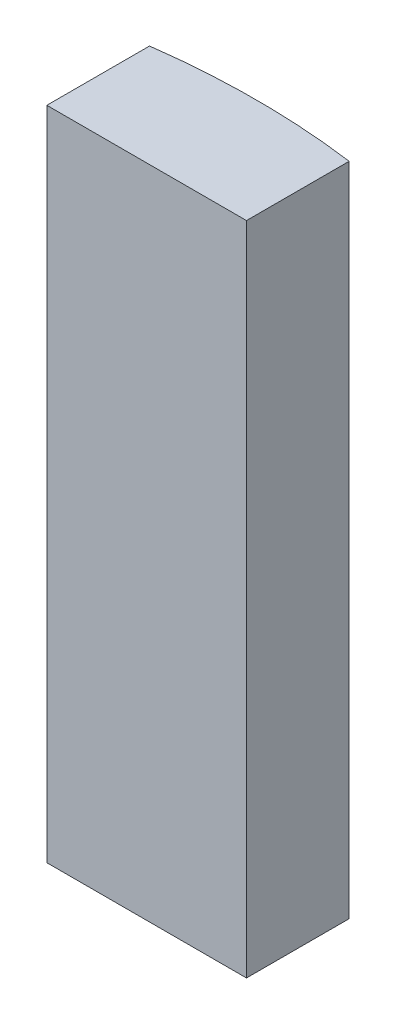
ISO-10303-21;
HEADER;
FILE_DESCRIPTION(('STEP AP214'),'2;1');
FILE_NAME('part.step','',(''),(''),'','','');
FILE_SCHEMA(('AUTOMOTIVE_DESIGN { 1 0 10303 214 1 1 1 1 }'));
ENDSEC;
DATA;
#1=APPLICATION_CONTEXT('core data for automotive mechanical design processes');
#2=APPLICATION_PROTOCOL_DEFINITION('international standard','automotive_design',2000,#1);
#3=PRODUCT_CONTEXT('',#1,'mechanical');
#4=PRODUCT('Part','Part','',(#3));
#5=PRODUCT_RELATED_PRODUCT_CATEGORY('part','',(#4));
#6=PRODUCT_DEFINITION_FORMATION('','',#4);
#7=PRODUCT_DEFINITION_CONTEXT('part definition',#1,'design');
#8=PRODUCT_DEFINITION('design','',#6,#7);
#9=PRODUCT_DEFINITION_SHAPE('','',#8);
#10=(LENGTH_UNIT() NAMED_UNIT(*) SI_UNIT(.MILLI.,.METRE.));
#11=(NAMED_UNIT(*) PLANE_ANGLE_UNIT() SI_UNIT($,.RADIAN.));
#12=(NAMED_UNIT(*) SI_UNIT($,.STERADIAN.) SOLID_ANGLE_UNIT());
#13=UNCERTAINTY_MEASURE_WITH_UNIT(LENGTH_MEASURE(1.E-05),#10,'distance_accuracy_value','');
#14=(GEOMETRIC_REPRESENTATION_CONTEXT(3) GLOBAL_UNCERTAINTY_ASSIGNED_CONTEXT((#13)) GLOBAL_UNIT_ASSIGNED_CONTEXT((#10,
#11,#12)) REPRESENTATION_CONTEXT('',''));
#15=CARTESIAN_POINT('',(0.,0.,0.));
#16=DIRECTION('',(0.,0.,1.));
#17=DIRECTION('',(1.,0.,0.));
#18=AXIS2_PLACEMENT_3D('',#15,#16,#17);
#19=CARTESIAN_POINT('',(1.74999999999999,11.5,10.8816730279883));
#20=DIRECTION('',(0.,-1.,0.));
#21=DIRECTION('',(0.,0.,-1.));
#22=AXIS2_PLACEMENT_3D('',#19,#20,#21);
#23=CYLINDRICAL_SURFACE('',#22,13.);
#24=CARTESIAN_POINT('',(1.74999999999999,0.,10.8816730279883));
#25=DIRECTION('',(0.,1.,0.));
#26=DIRECTION('',(0.,0.,1.));
#27=AXIS2_PLACEMENT_3D('',#24,#25,#26);
#28=CIRCLE('',#27,13.);
#29=CARTESIAN_POINT('',(3.5,0.,-2.));
#30=VERTEX_POINT('',#29);
#31=CARTESIAN_POINT('',(0.,0.,-2.));
#32=VERTEX_POINT('',#31);
#33=EDGE_CURVE('E99',#30,#32,#28,.T.);
#34=ORIENTED_EDGE('',*,*,#33,.T.);
#35=DIRECTION('',(0.,-1.,0.));
#36=VECTOR('',#35,1.);
#37=CARTESIAN_POINT('',(0.,11.5,-2.));
#38=LINE('',#37,#36);
#39=CARTESIAN_POINT('',(0.,11.5,-2.));
#40=VERTEX_POINT('',#39);
#41=EDGE_CURVE('E11',#40,#32,#38,.T.);
#42=ORIENTED_EDGE('',*,*,#41,.F.);
#43=CARTESIAN_POINT('',(1.74999999999999,11.5,10.8816730279883));
#44=DIRECTION('',(0.,1.,0.));
#45=DIRECTION('',(0.,0.,1.));
#46=AXIS2_PLACEMENT_3D('',#43,#44,#45);
#47=CIRCLE('',#46,13.);
#48=CARTESIAN_POINT('',(3.5,11.5,-2.));
#49=VERTEX_POINT('',#48);
#50=EDGE_CURVE('E87',#49,#40,#47,.T.);
#51=ORIENTED_EDGE('',*,*,#50,.F.);
#52=DIRECTION('',(0.,-1.,0.));
#53=VECTOR('',#52,1.);
#54=CARTESIAN_POINT('',(3.5,11.5,-2.));
#55=LINE('',#54,#53);
#56=EDGE_CURVE('E95',#49,#30,#55,.T.);
#57=ORIENTED_EDGE('',*,*,#56,.T.);
#58=EDGE_LOOP('',(#34,#42,#51,#57));
#59=FACE_BOUND('',#58,.T.);
#60=ADVANCED_FACE('F36',(#59),#23,.T.);
#61=CARTESIAN_POINT('',(0.,11.5,-2.));
#62=DIRECTION('',(1.,0.,0.));
#63=DIRECTION('',(0.,0.,-1.));
#64=AXIS2_PLACEMENT_3D('',#61,#62,#63);
#65=PLANE('',#64);
#66=DIRECTION('',(0.,0.,1.));
#67=VECTOR('',#66,1.);
#68=CARTESIAN_POINT('',(0.,0.,-2.));
#69=LINE('',#68,#67);
#70=CARTESIAN_POINT('',(0.,0.,-0.2));
#71=VERTEX_POINT('',#70);
#72=EDGE_CURVE('E91',#32,#71,#69,.T.);
#73=ORIENTED_EDGE('',*,*,#72,.T.);
#74=DIRECTION('',(0.,-1.,0.));
#75=VECTOR('',#74,1.);
#76=CARTESIAN_POINT('',(0.,11.5,-0.2));
#77=LINE('',#76,#75);
#78=CARTESIAN_POINT('',(0.,11.5,-0.2));
#79=VERTEX_POINT('',#78);
#80=EDGE_CURVE('E44',#79,#71,#77,.T.);
#81=ORIENTED_EDGE('',*,*,#80,.F.);
#82=DIRECTION('',(0.,0.,1.));
#83=VECTOR('',#82,1.);
#84=CARTESIAN_POINT('',(0.,11.5,-2.));
#85=LINE('',#84,#83);
#86=EDGE_CURVE('E82',#40,#79,#85,.T.);
#87=ORIENTED_EDGE('',*,*,#86,.F.);
#88=ORIENTED_EDGE('',*,*,#41,.T.);
#89=EDGE_LOOP('',(#73,#81,#87,#88));
#90=FACE_BOUND('',#89,.T.);
#91=ADVANCED_FACE('F90',(#90),#65,.F.);
#92=CARTESIAN_POINT('',(0.,11.5,-0.2));
#93=DIRECTION('',(0.,0.,-1.));
#94=DIRECTION('',(-1.,0.,0.));
#95=AXIS2_PLACEMENT_3D('',#92,#93,#94);
#96=PLANE('',#95);
#97=DIRECTION('',(1.,0.,0.));
#98=VECTOR('',#97,1.);
#99=CARTESIAN_POINT('',(0.,0.,-0.2));
#100=LINE('',#99,#98);
#101=CARTESIAN_POINT('',(3.5,0.,-0.2));
#102=VERTEX_POINT('',#101);
#103=EDGE_CURVE('E69',#71,#102,#100,.T.);
#104=ORIENTED_EDGE('',*,*,#103,.T.);
#105=DIRECTION('',(0.,-1.,0.));
#106=VECTOR('',#105,1.);
#107=CARTESIAN_POINT('',(3.5,11.5,-0.2));
#108=LINE('',#107,#106);
#109=CARTESIAN_POINT('',(3.5,11.5,-0.2));
#110=VERTEX_POINT('',#109);
#111=EDGE_CURVE('E92',#110,#102,#108,.T.);
#112=ORIENTED_EDGE('',*,*,#111,.F.);
#113=DIRECTION('',(1.,0.,0.));
#114=VECTOR('',#113,1.);
#115=CARTESIAN_POINT('',(0.,11.5,-0.2));
#116=LINE('',#115,#114);
#117=EDGE_CURVE('E85',#79,#110,#116,.T.);
#118=ORIENTED_EDGE('',*,*,#117,.F.);
#119=ORIENTED_EDGE('',*,*,#80,.T.);
#120=EDGE_LOOP('',(#104,#112,#118,#119));
#121=FACE_BOUND('',#120,.T.);
#122=ADVANCED_FACE('F93',(#121),#96,.F.);
#123=CARTESIAN_POINT('',(3.5,11.5,-0.2));
#124=DIRECTION('',(-1.,0.,0.));
#125=DIRECTION('',(0.,0.,1.));
#126=AXIS2_PLACEMENT_3D('',#123,#124,#125);
#127=PLANE('',#126);
#128=DIRECTION('',(0.,0.,-1.));
#129=VECTOR('',#128,1.);
#130=CARTESIAN_POINT('',(3.5,0.,-0.2));
#131=LINE('',#130,#129);
#132=EDGE_CURVE('E75',#102,#30,#131,.T.);
#133=ORIENTED_EDGE('',*,*,#132,.T.);
#134=ORIENTED_EDGE('',*,*,#56,.F.);
#135=DIRECTION('',(0.,0.,-1.));
#136=VECTOR('',#135,1.);
#137=CARTESIAN_POINT('',(3.5,11.5,-0.2));
#138=LINE('',#137,#136);
#139=EDGE_CURVE('E52',#110,#49,#138,.T.);
#140=ORIENTED_EDGE('',*,*,#139,.F.);
#141=ORIENTED_EDGE('',*,*,#111,.T.);
#142=EDGE_LOOP('',(#133,#134,#140,#141));
#143=FACE_BOUND('',#142,.T.);
#144=ADVANCED_FACE('F106',(#143),#127,.F.);
#145=CARTESIAN_POINT('',(1.74999999999999,11.5,10.8816730279883));
#146=DIRECTION('',(0.,1.,0.));
#147=DIRECTION('',(0.,0.,1.));
#148=AXIS2_PLACEMENT_3D('',#145,#146,#147);
#149=PLANE('',#148);
#150=ORIENTED_EDGE('',*,*,#50,.T.);
#151=ORIENTED_EDGE('',*,*,#86,.T.);
#152=ORIENTED_EDGE('',*,*,#117,.T.);
#153=ORIENTED_EDGE('',*,*,#139,.T.);
#154=EDGE_LOOP('',(#150,#151,#152,#153));
#155=FACE_BOUND('',#154,.T.);
#156=ADVANCED_FACE('F83',(#155),#149,.T.);
#157=CARTESIAN_POINT('',(1.74999999999999,0.,10.8816730279883));
#158=DIRECTION('',(0.,1.,0.));
#159=DIRECTION('',(0.,0.,1.));
#160=AXIS2_PLACEMENT_3D('',#157,#158,#159);
#161=PLANE('',#160);
#162=ORIENTED_EDGE('',*,*,#33,.F.);
#163=ORIENTED_EDGE('',*,*,#132,.F.);
#164=ORIENTED_EDGE('',*,*,#103,.F.);
#165=ORIENTED_EDGE('',*,*,#72,.F.);
#166=EDGE_LOOP('',(#162,#163,#164,#165));
#167=FACE_BOUND('',#166,.T.);
#168=ADVANCED_FACE('F109',(#167),#161,.F.);
#169=CLOSED_SHELL('',(#60,#91,#122,#144,#156,#168));
#170=MANIFOLD_SOLID_BREP('B2',#169);
#171=ADVANCED_BREP_SHAPE_REPRESENTATION('',(#18,#170),#14);
#172=SHAPE_DEFINITION_REPRESENTATION(#9,#171);
ENDSEC;
END-ISO-10303-21;
